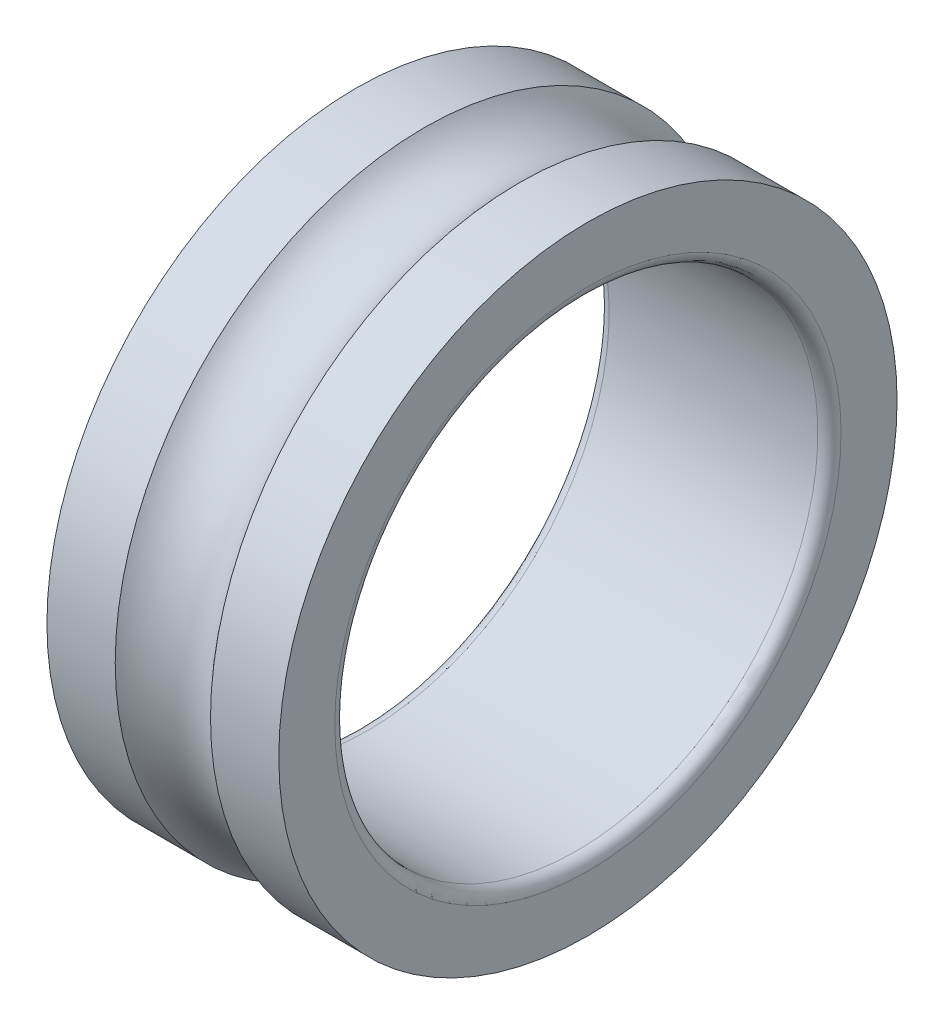
ISO-10303-21;
HEADER;
FILE_DESCRIPTION(('STEP AP214'),'2;1');
FILE_NAME('part.step','',(''),(''),'','','');
FILE_SCHEMA(('AUTOMOTIVE_DESIGN { 1 0 10303 214 1 1 1 1 }'));
ENDSEC;
DATA;
#1=APPLICATION_CONTEXT('core data for automotive mechanical design processes');
#2=APPLICATION_PROTOCOL_DEFINITION('international standard','automotive_design',2000,#1);
#3=PRODUCT_CONTEXT('',#1,'mechanical');
#4=PRODUCT('Part','Part','',(#3));
#5=PRODUCT_RELATED_PRODUCT_CATEGORY('part','',(#4));
#6=PRODUCT_DEFINITION_FORMATION('','',#4);
#7=PRODUCT_DEFINITION_CONTEXT('part definition',#1,'design');
#8=PRODUCT_DEFINITION('design','',#6,#7);
#9=PRODUCT_DEFINITION_SHAPE('','',#8);
#10=(LENGTH_UNIT() NAMED_UNIT(*) SI_UNIT(.MILLI.,.METRE.));
#11=(NAMED_UNIT(*) PLANE_ANGLE_UNIT() SI_UNIT($,.RADIAN.));
#12=(NAMED_UNIT(*) SI_UNIT($,.STERADIAN.) SOLID_ANGLE_UNIT());
#13=UNCERTAINTY_MEASURE_WITH_UNIT(LENGTH_MEASURE(1.E-05),#10,'distance_accuracy_value','');
#14=(GEOMETRIC_REPRESENTATION_CONTEXT(3) GLOBAL_UNCERTAINTY_ASSIGNED_CONTEXT((#13)) GLOBAL_UNIT_ASSIGNED_CONTEXT((#10,
#11,#12)) REPRESENTATION_CONTEXT('',''));
#15=CARTESIAN_POINT('',(0.,0.,0.));
#16=DIRECTION('',(0.,0.,1.));
#17=DIRECTION('',(1.,0.,0.));
#18=AXIS2_PLACEMENT_3D('',#15,#16,#17);
#19=CARTESIAN_POINT('',(0.6,0.,0.));
#20=DIRECTION('',(1.,0.,0.));
#21=DIRECTION('',(0.,0.,-1.));
#22=AXIS2_PLACEMENT_3D('',#19,#20,#21);
#23=CYLINDRICAL_SURFACE('',#22,12.5);
#24=CARTESIAN_POINT('',(0.6,0.,0.));
#25=DIRECTION('',(1.,0.,0.));
#26=DIRECTION('',(0.,1.,0.));
#27=AXIS2_PLACEMENT_3D('',#24,#25,#26);
#28=CIRCLE('',#27,12.5);
#29=CARTESIAN_POINT('',(0.6,12.5,0.));
#30=VERTEX_POINT('',#29);
#31=EDGE_CURVE('E68',#30,#30,#28,.T.);
#32=ORIENTED_EDGE('',*,*,#31,.F.);
#33=EDGE_LOOP('',(#32));
#34=FACE_BOUND('',#33,.T.);
#35=CARTESIAN_POINT('',(11.4,0.,0.));
#36=DIRECTION('',(1.,0.,0.));
#37=DIRECTION('',(0.,1.,0.));
#38=AXIS2_PLACEMENT_3D('',#35,#36,#37);
#39=CIRCLE('',#38,12.5);
#40=CARTESIAN_POINT('',(11.4,12.5,0.));
#41=VERTEX_POINT('',#40);
#42=EDGE_CURVE('E71',#41,#41,#39,.F.);
#43=ORIENTED_EDGE('',*,*,#42,.F.);
#44=EDGE_LOOP('',(#43));
#45=FACE_BOUND('',#44,.T.);
#46=ADVANCED_FACE('F14',(#34,#45),#23,.F.);
#47=CARTESIAN_POINT('',(11.4,0.,0.));
#48=DIRECTION('',(1.,0.,0.));
#49=DIRECTION('',(0.,1.,0.));
#50=AXIS2_PLACEMENT_3D('',#47,#48,#49);
#51=TOROIDAL_SURFACE('',#50,13.1,0.600000000000001);
#52=CARTESIAN_POINT('',(12.,0.,0.));
#53=DIRECTION('',(1.,0.,0.));
#54=DIRECTION('',(0.,0.,1.));
#55=AXIS2_PLACEMENT_3D('',#52,#53,#54);
#56=CIRCLE('',#55,13.1);
#57=CARTESIAN_POINT('',(12.,0.,13.1));
#58=VERTEX_POINT('',#57);
#59=EDGE_CURVE('E38',#58,#58,#56,.F.);
#60=ORIENTED_EDGE('',*,*,#59,.F.);
#61=EDGE_LOOP('',(#60));
#62=FACE_BOUND('',#61,.T.);
#63=ORIENTED_EDGE('',*,*,#42,.T.);
#64=EDGE_LOOP('',(#63));
#65=FACE_BOUND('',#64,.T.);
#66=ADVANCED_FACE('F60',(#62,#65),#51,.T.);
#67=CARTESIAN_POINT('',(0.6,0.,0.));
#68=DIRECTION('',(1.,0.,0.));
#69=DIRECTION('',(0.,1.,0.));
#70=AXIS2_PLACEMENT_3D('',#67,#68,#69);
#71=TOROIDAL_SURFACE('',#70,13.1,0.6);
#72=ORIENTED_EDGE('',*,*,#31,.T.);
#73=EDGE_LOOP('',(#72));
#74=FACE_BOUND('',#73,.T.);
#75=CARTESIAN_POINT('',(0.,0.,0.));
#76=DIRECTION('',(-1.,0.,0.));
#77=DIRECTION('',(0.,0.,1.));
#78=AXIS2_PLACEMENT_3D('',#75,#76,#77);
#79=CIRCLE('',#78,13.1);
#80=CARTESIAN_POINT('',(0.,0.,13.1));
#81=VERTEX_POINT('',#80);
#82=EDGE_CURVE('E75',#81,#81,#79,.F.);
#83=ORIENTED_EDGE('',*,*,#82,.F.);
#84=EDGE_LOOP('',(#83));
#85=FACE_BOUND('',#84,.T.);
#86=ADVANCED_FACE('F53',(#74,#85),#71,.T.);
#87=CARTESIAN_POINT('',(12.,0.,14.55));
#88=DIRECTION('',(1.,0.,0.));
#89=DIRECTION('',(0.,0.,-1.));
#90=AXIS2_PLACEMENT_3D('',#87,#88,#89);
#91=PLANE('',#90);
#92=CARTESIAN_POINT('',(12.,0.,0.));
#93=DIRECTION('',(1.,0.,0.));
#94=DIRECTION('',(0.,0.,-1.));
#95=AXIS2_PLACEMENT_3D('',#92,#93,#94);
#96=CIRCLE('',#95,16.);
#97=CARTESIAN_POINT('',(12.,0.,-16.));
#98=VERTEX_POINT('',#97);
#99=EDGE_CURVE('E17',#98,#98,#96,.F.);
#100=ORIENTED_EDGE('',*,*,#99,.F.);
#101=EDGE_LOOP('',(#100));
#102=FACE_BOUND('',#101,.T.);
#103=ORIENTED_EDGE('',*,*,#59,.T.);
#104=EDGE_LOOP('',(#103));
#105=FACE_BOUND('',#104,.T.);
#106=ADVANCED_FACE('F43',(#102,#105),#91,.T.);
#107=CARTESIAN_POINT('',(0.,0.,14.55));
#108=DIRECTION('',(-1.,0.,0.));
#109=DIRECTION('',(0.,0.,1.));
#110=AXIS2_PLACEMENT_3D('',#107,#108,#109);
#111=PLANE('',#110);
#112=ORIENTED_EDGE('',*,*,#82,.T.);
#113=EDGE_LOOP('',(#112));
#114=FACE_BOUND('',#113,.T.);
#115=CARTESIAN_POINT('',(0.,0.,0.));
#116=DIRECTION('',(1.,0.,0.));
#117=DIRECTION('',(0.,0.,-1.));
#118=AXIS2_PLACEMENT_3D('',#115,#116,#117);
#119=CIRCLE('',#118,16.);
#120=CARTESIAN_POINT('',(0.,0.,-16.));
#121=VERTEX_POINT('',#120);
#122=EDGE_CURVE('E26',#121,#121,#119,.T.);
#123=ORIENTED_EDGE('',*,*,#122,.F.);
#124=EDGE_LOOP('',(#123));
#125=FACE_BOUND('',#124,.T.);
#126=ADVANCED_FACE('F52',(#114,#125),#111,.T.);
#127=CARTESIAN_POINT('',(10.232946166708,0.,0.));
#128=DIRECTION('',(1.,0.,0.));
#129=DIRECTION('',(0.,0.,-1.));
#130=AXIS2_PLACEMENT_3D('',#127,#128,#129);
#131=CYLINDRICAL_SURFACE('',#130,16.);
#132=ORIENTED_EDGE('',*,*,#99,.T.);
#133=EDGE_LOOP('',(#132));
#134=FACE_BOUND('',#133,.T.);
#135=CARTESIAN_POINT('',(8.46589233341604,0.,0.));
#136=DIRECTION('',(1.,0.,0.));
#137=DIRECTION('',(0.,1.,0.));
#138=AXIS2_PLACEMENT_3D('',#135,#136,#137);
#139=CIRCLE('',#138,16.);
#140=CARTESIAN_POINT('',(8.46589233341604,16.,0.));
#141=VERTEX_POINT('',#140);
#142=EDGE_CURVE('E21',#141,#141,#139,.F.);
#143=ORIENTED_EDGE('',*,*,#142,.F.);
#144=EDGE_LOOP('',(#143));
#145=FACE_BOUND('',#144,.T.);
#146=ADVANCED_FACE('F112',(#134,#145),#131,.T.);
#147=CARTESIAN_POINT('',(1.76705383329198,0.,0.));
#148=DIRECTION('',(1.,0.,0.));
#149=DIRECTION('',(0.,0.,-1.));
#150=AXIS2_PLACEMENT_3D('',#147,#148,#149);
#151=CYLINDRICAL_SURFACE('',#150,16.);
#152=CARTESIAN_POINT('',(3.53410766658396,0.,0.));
#153=DIRECTION('',(1.,0.,0.));
#154=DIRECTION('',(0.,1.,0.));
#155=AXIS2_PLACEMENT_3D('',#152,#153,#154);
#156=CIRCLE('',#155,16.);
#157=CARTESIAN_POINT('',(3.53410766658396,16.,0.));
#158=VERTEX_POINT('',#157);
#159=EDGE_CURVE('E10',#158,#158,#156,.T.);
#160=ORIENTED_EDGE('',*,*,#159,.F.);
#161=EDGE_LOOP('',(#160));
#162=FACE_BOUND('',#161,.T.);
#163=ORIENTED_EDGE('',*,*,#122,.T.);
#164=EDGE_LOOP('',(#163));
#165=FACE_BOUND('',#164,.T.);
#166=ADVANCED_FACE('F110',(#162,#165),#151,.T.);
#167=CARTESIAN_POINT('',(6.,0.,0.));
#168=DIRECTION('',(1.,0.,0.));
#169=DIRECTION('',(0.,1.,0.));
#170=AXIS2_PLACEMENT_3D('',#167,#168,#169);
#171=TOROIDAL_SURFACE('',#170,18.,3.175);
#172=ORIENTED_EDGE('',*,*,#159,.T.);
#173=EDGE_LOOP('',(#172));
#174=FACE_BOUND('',#173,.T.);
#175=ORIENTED_EDGE('',*,*,#142,.T.);
#176=EDGE_LOOP('',(#175));
#177=FACE_BOUND('',#176,.T.);
#178=ADVANCED_FACE('F107',(#174,#177),#171,.F.);
#179=CLOSED_SHELL('',(#46,#66,#86,#106,#126,#146,#166,#178));
#180=MANIFOLD_SOLID_BREP('B1',#179);
#181=ADVANCED_BREP_SHAPE_REPRESENTATION('',(#18,#180),#14);
#182=SHAPE_DEFINITION_REPRESENTATION(#9,#181);
ENDSEC;
END-ISO-10303-21;
